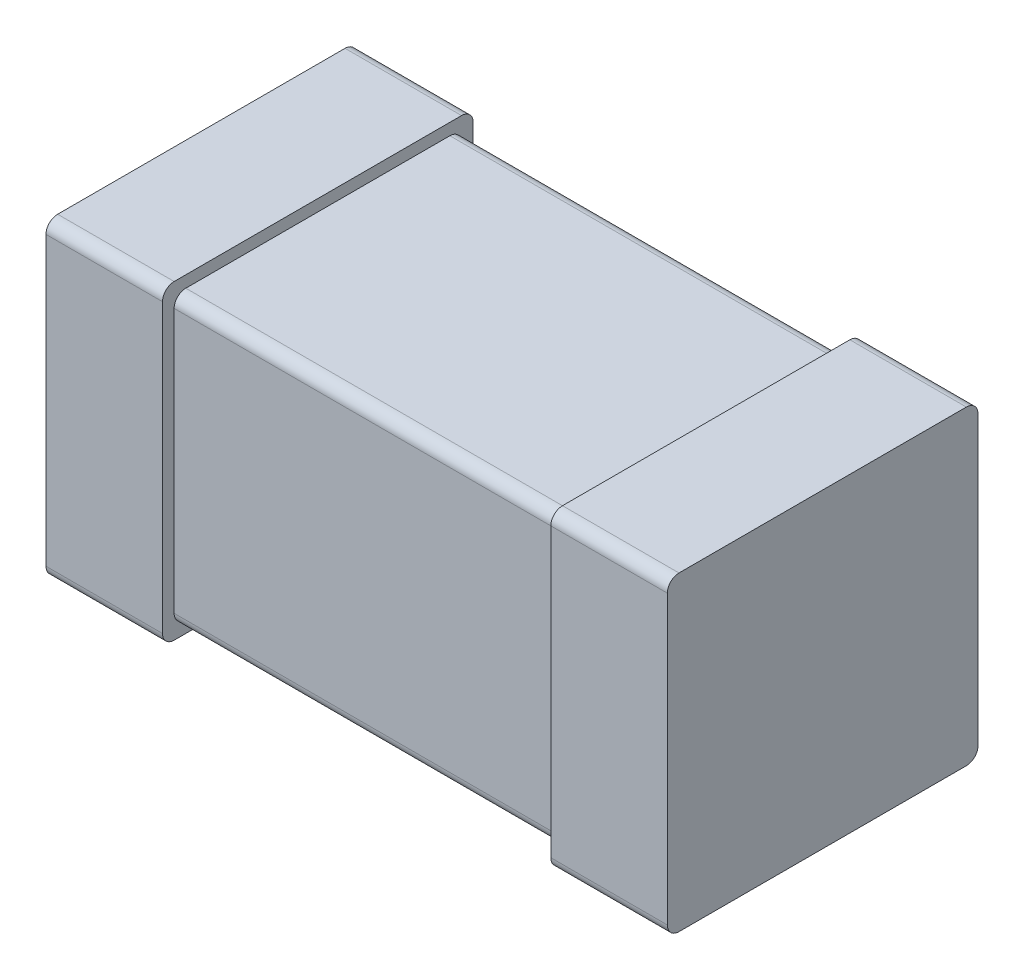
ISO-10303-21;
HEADER;
FILE_DESCRIPTION(('STEP AP214'),'2;1');
FILE_NAME('part.step','',(''),(''),'','','');
FILE_SCHEMA(('AUTOMOTIVE_DESIGN { 1 0 10303 214 1 1 1 1 }'));
ENDSEC;
DATA;
#1=APPLICATION_CONTEXT('core data for automotive mechanical design processes');
#2=APPLICATION_PROTOCOL_DEFINITION('international standard','automotive_design',2000,#1);
#3=PRODUCT_CONTEXT('',#1,'mechanical');
#4=PRODUCT('Part','Part','',(#3));
#5=PRODUCT_RELATED_PRODUCT_CATEGORY('part','',(#4));
#6=PRODUCT_DEFINITION_FORMATION('','',#4);
#7=PRODUCT_DEFINITION_CONTEXT('part definition',#1,'design');
#8=PRODUCT_DEFINITION('design','',#6,#7);
#9=PRODUCT_DEFINITION_SHAPE('','',#8);
#10=(LENGTH_UNIT() NAMED_UNIT(*) SI_UNIT(.MILLI.,.METRE.));
#11=(NAMED_UNIT(*) PLANE_ANGLE_UNIT() SI_UNIT($,.RADIAN.));
#12=(NAMED_UNIT(*) SI_UNIT($,.STERADIAN.) SOLID_ANGLE_UNIT());
#13=UNCERTAINTY_MEASURE_WITH_UNIT(LENGTH_MEASURE(1.E-05),#10,'distance_accuracy_value','');
#14=(GEOMETRIC_REPRESENTATION_CONTEXT(3) GLOBAL_UNCERTAINTY_ASSIGNED_CONTEXT((#13)) GLOBAL_UNIT_ASSIGNED_CONTEXT((#10,
#11,#12)) REPRESENTATION_CONTEXT('',''));
#15=CARTESIAN_POINT('',(0.,0.,0.));
#16=DIRECTION('',(0.,0.,1.));
#17=DIRECTION('',(1.,0.,0.));
#18=AXIS2_PLACEMENT_3D('',#15,#16,#17);
#19=CARTESIAN_POINT('',(118.743244279938,101.39204329235,142.211582908599));
#20=DIRECTION('',(1.,0.,0.));
#21=DIRECTION('',(0.,1.,0.));
#22=AXIS2_PLACEMENT_3D('',#19,#20,#21);
#23=PLANE('',#22);
#24=DIRECTION('',(0.,0.,1.));
#25=VECTOR('',#24,1.);
#26=CARTESIAN_POINT('',(118.743244279938,101.39204329235,142.211582908599));
#27=LINE('',#26,#25);
#28=CARTESIAN_POINT('',(118.743244279938,101.39204329235,142.241582908599));
#29=VERTEX_POINT('',#28);
#30=CARTESIAN_POINT('',(118.743244279938,101.39204329235,142.981582908599));
#31=VERTEX_POINT('',#30);
#32=EDGE_CURVE('E67',#29,#31,#27,.T.);
#33=ORIENTED_EDGE('',*,*,#32,.F.);
#34=CARTESIAN_POINT('',(118.743244279938,101.42204329235,142.241582908599));
#35=DIRECTION('',(1.,0.,0.));
#36=DIRECTION('',(0.,0.,1.));
#37=AXIS2_PLACEMENT_3D('',#34,#35,#36);
#38=CIRCLE('',#37,0.0300000000000023);
#39=CARTESIAN_POINT('',(118.743244279938,101.42204329235,142.211582908599));
#40=VERTEX_POINT('',#39);
#41=EDGE_CURVE('E11',#29,#40,#38,.T.);
#42=ORIENTED_EDGE('',*,*,#41,.T.);
#43=DIRECTION('',(0.,1.,0.));
#44=VECTOR('',#43,1.);
#45=CARTESIAN_POINT('',(118.743244279938,101.39204329235,142.211582908599));
#46=LINE('',#45,#44);
#47=CARTESIAN_POINT('',(118.743244279938,102.16204329235,142.211582908599));
#48=VERTEX_POINT('',#47);
#49=EDGE_CURVE('E55',#40,#48,#46,.T.);
#50=ORIENTED_EDGE('',*,*,#49,.T.);
#51=CARTESIAN_POINT('',(118.743244279938,102.16204329235,142.241582908599));
#52=DIRECTION('',(-1.,0.,0.));
#53=DIRECTION('',(0.,0.,1.));
#54=AXIS2_PLACEMENT_3D('',#51,#52,#53);
#55=CIRCLE('',#54,0.0300000000000023);
#56=CARTESIAN_POINT('',(118.743244279938,102.19204329235,142.241582908599));
#57=VERTEX_POINT('',#56);
#58=EDGE_CURVE('E48',#57,#48,#55,.T.);
#59=ORIENTED_EDGE('',*,*,#58,.F.);
#60=DIRECTION('',(0.,0.,1.));
#61=VECTOR('',#60,1.);
#62=CARTESIAN_POINT('',(118.743244279938,102.19204329235,142.211582908599));
#63=LINE('',#62,#61);
#64=CARTESIAN_POINT('',(118.743244279938,102.19204329235,142.981582908599));
#65=VERTEX_POINT('',#64);
#66=EDGE_CURVE('E367',#57,#65,#63,.T.);
#67=ORIENTED_EDGE('',*,*,#66,.T.);
#68=CARTESIAN_POINT('',(118.743244279938,102.16204329235,142.981582908599));
#69=DIRECTION('',(1.,0.,0.));
#70=DIRECTION('',(0.,0.,1.));
#71=AXIS2_PLACEMENT_3D('',#68,#69,#70);
#72=CIRCLE('',#71,0.0300000000000023);
#73=CARTESIAN_POINT('',(118.743244279938,102.16204329235,143.011582908599));
#74=VERTEX_POINT('',#73);
#75=EDGE_CURVE('E371',#65,#74,#72,.T.);
#76=ORIENTED_EDGE('',*,*,#75,.T.);
#77=DIRECTION('',(0.,1.,0.));
#78=VECTOR('',#77,1.);
#79=CARTESIAN_POINT('',(118.743244279938,101.39204329235,143.011582908599));
#80=LINE('',#79,#78);
#81=CARTESIAN_POINT('',(118.743244279938,101.42204329235,143.011582908599));
#82=VERTEX_POINT('',#81);
#83=EDGE_CURVE('E327',#82,#74,#80,.T.);
#84=ORIENTED_EDGE('',*,*,#83,.F.);
#85=CARTESIAN_POINT('',(118.743244279938,101.42204329235,142.981582908599));
#86=DIRECTION('',(-1.,0.,0.));
#87=DIRECTION('',(0.,0.,1.));
#88=AXIS2_PLACEMENT_3D('',#85,#86,#87);
#89=CIRCLE('',#88,0.0300000000000023);
#90=EDGE_CURVE('E457',#31,#82,#89,.T.);
#91=ORIENTED_EDGE('',*,*,#90,.F.);
#92=EDGE_LOOP('',(#33,#42,#50,#59,#67,#76,#84,#91));
#93=FACE_BOUND('',#92,.T.);
#94=ADVANCED_FACE('F44',(#93),#23,.T.);
#95=CARTESIAN_POINT('',(118.443244279938,102.19204329235,142.211582908599));
#96=DIRECTION('',(0.,1.,0.));
#97=DIRECTION('',(1.,0.,0.));
#98=AXIS2_PLACEMENT_3D('',#95,#96,#97);
#99=PLANE('',#98);
#100=ORIENTED_EDGE('',*,*,#66,.F.);
#101=DIRECTION('',(1.,0.,0.));
#102=VECTOR('',#101,1.);
#103=CARTESIAN_POINT('',(118.443244279938,102.19204329235,142.241582908599));
#104=LINE('',#103,#102);
#105=CARTESIAN_POINT('',(118.443244279938,102.19204329235,142.241582908599));
#106=VERTEX_POINT('',#105);
#107=EDGE_CURVE('E316',#106,#57,#104,.T.);
#108=ORIENTED_EDGE('',*,*,#107,.F.);
#109=DIRECTION('',(0.,0.,1.));
#110=VECTOR('',#109,1.);
#111=CARTESIAN_POINT('',(118.443244279938,102.19204329235,142.211582908599));
#112=LINE('',#111,#110);
#113=CARTESIAN_POINT('',(118.443244279938,102.19204329235,142.981582908599));
#114=VERTEX_POINT('',#113);
#115=EDGE_CURVE('E382',#106,#114,#112,.T.);
#116=ORIENTED_EDGE('',*,*,#115,.T.);
#117=DIRECTION('',(1.,0.,0.));
#118=VECTOR('',#117,1.);
#119=CARTESIAN_POINT('',(118.443244279938,102.19204329235,142.981582908599));
#120=LINE('',#119,#118);
#121=EDGE_CURVE('E403',#114,#65,#120,.T.);
#122=ORIENTED_EDGE('',*,*,#121,.T.);
#123=EDGE_LOOP('',(#100,#108,#116,#122));
#124=FACE_BOUND('',#123,.T.);
#125=ADVANCED_FACE('F580',(#124),#99,.T.);
#126=CARTESIAN_POINT('',(118.443244279938,102.16204329235,142.981582908599));
#127=DIRECTION('',(1.,0.,0.));
#128=DIRECTION('',(0.,1.,0.));
#129=AXIS2_PLACEMENT_3D('',#126,#127,#128);
#130=CYLINDRICAL_SURFACE('',#129,0.0300000000000023);
#131=CARTESIAN_POINT('',(118.443244279938,102.16204329235,142.981582908599));
#132=DIRECTION('',(1.,0.,0.));
#133=DIRECTION('',(0.,0.,1.));
#134=AXIS2_PLACEMENT_3D('',#131,#132,#133);
#135=CIRCLE('',#134,0.0300000000000023);
#136=CARTESIAN_POINT('',(118.443244279938,102.16204329235,143.011582908599));
#137=VERTEX_POINT('',#136);
#138=EDGE_CURVE('E405',#114,#137,#135,.T.);
#139=ORIENTED_EDGE('',*,*,#138,.T.);
#140=DIRECTION('',(1.,0.,0.));
#141=VECTOR('',#140,1.);
#142=CARTESIAN_POINT('',(118.443244279938,102.16204329235,143.011582908599));
#143=LINE('',#142,#141);
#144=EDGE_CURVE('E410',#137,#74,#143,.T.);
#145=ORIENTED_EDGE('',*,*,#144,.T.);
#146=ORIENTED_EDGE('',*,*,#75,.F.);
#147=ORIENTED_EDGE('',*,*,#121,.F.);
#148=EDGE_LOOP('',(#139,#145,#146,#147));
#149=FACE_BOUND('',#148,.T.);
#150=ADVANCED_FACE('F585',(#149),#130,.T.);
#151=CARTESIAN_POINT('',(118.443244279938,102.16204329235,142.241582908599));
#152=DIRECTION('',(1.,0.,0.));
#153=DIRECTION('',(0.,1.,0.));
#154=AXIS2_PLACEMENT_3D('',#151,#152,#153);
#155=CYLINDRICAL_SURFACE('',#154,0.0300000000000023);
#156=ORIENTED_EDGE('',*,*,#107,.T.);
#157=ORIENTED_EDGE('',*,*,#58,.T.);
#158=DIRECTION('',(1.,0.,0.));
#159=VECTOR('',#158,1.);
#160=CARTESIAN_POINT('',(118.443244279938,102.16204329235,142.211582908599));
#161=LINE('',#160,#159);
#162=CARTESIAN_POINT('',(118.443244279938,102.16204329235,142.211582908599));
#163=VERTEX_POINT('',#162);
#164=EDGE_CURVE('E442',#163,#48,#161,.T.);
#165=ORIENTED_EDGE('',*,*,#164,.F.);
#166=CARTESIAN_POINT('',(118.443244279938,102.16204329235,142.241582908599));
#167=DIRECTION('',(-1.,0.,0.));
#168=DIRECTION('',(0.,0.,1.));
#169=AXIS2_PLACEMENT_3D('',#166,#167,#168);
#170=CIRCLE('',#169,0.0300000000000023);
#171=EDGE_CURVE('E321',#106,#163,#170,.T.);
#172=ORIENTED_EDGE('',*,*,#171,.F.);
#173=EDGE_LOOP('',(#156,#157,#165,#172));
#174=FACE_BOUND('',#173,.T.);
#175=ADVANCED_FACE('F746',(#174),#155,.T.);
#176=CARTESIAN_POINT('',(118.443244279938,101.39204329235,143.011582908599));
#177=DIRECTION('',(0.,0.,1.));
#178=DIRECTION('',(1.,0.,0.));
#179=AXIS2_PLACEMENT_3D('',#176,#177,#178);
#180=PLANE('',#179);
#181=DIRECTION('',(0.,1.,0.));
#182=VECTOR('',#181,1.);
#183=CARTESIAN_POINT('',(118.443244279938,101.39204329235,143.011582908599));
#184=LINE('',#183,#182);
#185=CARTESIAN_POINT('',(118.443244279938,101.42204329235,143.011582908599));
#186=VERTEX_POINT('',#185);
#187=EDGE_CURVE('E411',#186,#137,#184,.T.);
#188=ORIENTED_EDGE('',*,*,#187,.F.);
#189=DIRECTION('',(1.,0.,0.));
#190=VECTOR('',#189,1.);
#191=CARTESIAN_POINT('',(118.443244279938,101.42204329235,143.011582908599));
#192=LINE('',#191,#190);
#193=EDGE_CURVE('E323',#186,#82,#192,.T.);
#194=ORIENTED_EDGE('',*,*,#193,.T.);
#195=ORIENTED_EDGE('',*,*,#83,.T.);
#196=ORIENTED_EDGE('',*,*,#144,.F.);
#197=EDGE_LOOP('',(#188,#194,#195,#196));
#198=FACE_BOUND('',#197,.T.);
#199=ADVANCED_FACE('F750',(#198),#180,.T.);
#200=CARTESIAN_POINT('',(118.443244279938,101.39204329235,142.211582908599));
#201=DIRECTION('',(0.,0.,1.));
#202=DIRECTION('',(1.,0.,0.));
#203=AXIS2_PLACEMENT_3D('',#200,#201,#202);
#204=PLANE('',#203);
#205=ORIENTED_EDGE('',*,*,#164,.T.);
#206=ORIENTED_EDGE('',*,*,#49,.F.);
#207=DIRECTION('',(1.,0.,0.));
#208=VECTOR('',#207,1.);
#209=CARTESIAN_POINT('',(118.443244279938,101.42204329235,142.211582908599));
#210=LINE('',#209,#208);
#211=CARTESIAN_POINT('',(118.443244279938,101.42204329235,142.211582908599));
#212=VERTEX_POINT('',#211);
#213=EDGE_CURVE('E484',#212,#40,#210,.T.);
#214=ORIENTED_EDGE('',*,*,#213,.F.);
#215=DIRECTION('',(0.,1.,0.));
#216=VECTOR('',#215,1.);
#217=CARTESIAN_POINT('',(118.443244279938,101.39204329235,142.211582908599));
#218=LINE('',#217,#216);
#219=EDGE_CURVE('E438',#212,#163,#218,.T.);
#220=ORIENTED_EDGE('',*,*,#219,.T.);
#221=EDGE_LOOP('',(#205,#206,#214,#220));
#222=FACE_BOUND('',#221,.T.);
#223=ADVANCED_FACE('F702',(#222),#204,.F.);
#224=CARTESIAN_POINT('',(118.443244279938,101.42204329235,142.981582908599));
#225=DIRECTION('',(1.,0.,0.));
#226=DIRECTION('',(0.,-1.,0.));
#227=AXIS2_PLACEMENT_3D('',#224,#225,#226);
#228=CYLINDRICAL_SURFACE('',#227,0.0300000000000023);
#229=DIRECTION('',(1.,0.,0.));
#230=VECTOR('',#229,1.);
#231=CARTESIAN_POINT('',(118.443244279938,101.39204329235,142.981582908599));
#232=LINE('',#231,#230);
#233=CARTESIAN_POINT('',(118.443244279938,101.39204329235,142.981582908599));
#234=VERTEX_POINT('',#233);
#235=EDGE_CURVE('E443',#234,#31,#232,.T.);
#236=ORIENTED_EDGE('',*,*,#235,.T.);
#237=ORIENTED_EDGE('',*,*,#90,.T.);
#238=ORIENTED_EDGE('',*,*,#193,.F.);
#239=CARTESIAN_POINT('',(118.443244279938,101.42204329235,142.981582908599));
#240=DIRECTION('',(-1.,0.,0.));
#241=DIRECTION('',(0.,0.,1.));
#242=AXIS2_PLACEMENT_3D('',#239,#240,#241);
#243=CIRCLE('',#242,0.0300000000000023);
#244=EDGE_CURVE('E356',#234,#186,#243,.T.);
#245=ORIENTED_EDGE('',*,*,#244,.F.);
#246=EDGE_LOOP('',(#236,#237,#238,#245));
#247=FACE_BOUND('',#246,.T.);
#248=ADVANCED_FACE('F698',(#247),#228,.T.);
#249=CARTESIAN_POINT('',(118.443244279938,101.42204329235,142.241582908599));
#250=DIRECTION('',(1.,0.,0.));
#251=DIRECTION('',(0.,-1.,0.));
#252=AXIS2_PLACEMENT_3D('',#249,#250,#251);
#253=CYLINDRICAL_SURFACE('',#252,0.0300000000000023);
#254=CARTESIAN_POINT('',(118.443244279938,101.42204329235,142.241582908599));
#255=DIRECTION('',(1.,0.,0.));
#256=DIRECTION('',(0.,0.,1.));
#257=AXIS2_PLACEMENT_3D('',#254,#255,#256);
#258=CIRCLE('',#257,0.0300000000000023);
#259=CARTESIAN_POINT('',(118.443244279938,101.39204329235,142.241582908599));
#260=VERTEX_POINT('',#259);
#261=EDGE_CURVE('E463',#260,#212,#258,.T.);
#262=ORIENTED_EDGE('',*,*,#261,.T.);
#263=ORIENTED_EDGE('',*,*,#213,.T.);
#264=ORIENTED_EDGE('',*,*,#41,.F.);
#265=DIRECTION('',(1.,0.,0.));
#266=VECTOR('',#265,1.);
#267=CARTESIAN_POINT('',(118.443244279938,101.39204329235,142.241582908599));
#268=LINE('',#267,#266);
#269=EDGE_CURVE('E355',#260,#29,#268,.T.);
#270=ORIENTED_EDGE('',*,*,#269,.F.);
#271=EDGE_LOOP('',(#262,#263,#264,#270));
#272=FACE_BOUND('',#271,.T.);
#273=ADVANCED_FACE('F634',(#272),#253,.T.);
#274=CARTESIAN_POINT('',(118.443244279938,101.39204329235,142.211582908599));
#275=DIRECTION('',(0.,1.,0.));
#276=DIRECTION('',(1.,0.,0.));
#277=AXIS2_PLACEMENT_3D('',#274,#275,#276);
#278=PLANE('',#277);
#279=ORIENTED_EDGE('',*,*,#235,.F.);
#280=DIRECTION('',(0.,0.,1.));
#281=VECTOR('',#280,1.);
#282=CARTESIAN_POINT('',(118.443244279938,101.39204329235,142.211582908599));
#283=LINE('',#282,#281);
#284=EDGE_CURVE('E318',#260,#234,#283,.T.);
#285=ORIENTED_EDGE('',*,*,#284,.F.);
#286=ORIENTED_EDGE('',*,*,#269,.T.);
#287=ORIENTED_EDGE('',*,*,#32,.T.);
#288=EDGE_LOOP('',(#279,#285,#286,#287));
#289=FACE_BOUND('',#288,.T.);
#290=ADVANCED_FACE('F630',(#289),#278,.F.);
#291=CARTESIAN_POINT('',(118.443244279938,101.39204329235,142.211582908599));
#292=DIRECTION('',(1.,0.,0.));
#293=DIRECTION('',(0.,1.,0.));
#294=AXIS2_PLACEMENT_3D('',#291,#292,#293);
#295=PLANE('',#294);
#296=ORIENTED_EDGE('',*,*,#244,.T.);
#297=ORIENTED_EDGE('',*,*,#187,.T.);
#298=ORIENTED_EDGE('',*,*,#138,.F.);
#299=ORIENTED_EDGE('',*,*,#115,.F.);
#300=ORIENTED_EDGE('',*,*,#171,.T.);
#301=ORIENTED_EDGE('',*,*,#219,.F.);
#302=ORIENTED_EDGE('',*,*,#261,.F.);
#303=ORIENTED_EDGE('',*,*,#284,.T.);
#304=EDGE_LOOP('',(#296,#297,#298,#299,#300,#301,#302,#303));
#305=FACE_BOUND('',#304,.T.);
#306=DIRECTION('',(0.,1.,0.));
#307=VECTOR('',#306,1.);
#308=CARTESIAN_POINT('',(118.443244279938,101.42204329235,142.241582908599));
#309=LINE('',#308,#307);
#310=CARTESIAN_POINT('',(118.443244279938,101.45204329235,142.241582908599));
#311=VERTEX_POINT('',#310);
#312=CARTESIAN_POINT('',(118.443244279938,102.13204329235,142.241582908599));
#313=VERTEX_POINT('',#312);
#314=EDGE_CURVE('E322',#311,#313,#309,.T.);
#315=ORIENTED_EDGE('',*,*,#314,.T.);
#316=CARTESIAN_POINT('',(118.443244279938,102.13204329235,142.271582908599));
#317=DIRECTION('',(-1.,0.,0.));
#318=DIRECTION('',(0.,0.,1.));
#319=AXIS2_PLACEMENT_3D('',#316,#317,#318);
#320=CIRCLE('',#319,0.0300000000000023);
#321=CARTESIAN_POINT('',(118.443244279938,102.16204329235,142.271582908599));
#322=VERTEX_POINT('',#321);
#323=EDGE_CURVE('E433',#322,#313,#320,.T.);
#324=ORIENTED_EDGE('',*,*,#323,.F.);
#325=DIRECTION('',(0.,0.,1.));
#326=VECTOR('',#325,1.);
#327=CARTESIAN_POINT('',(118.443244279938,102.16204329235,142.241582908599));
#328=LINE('',#327,#326);
#329=CARTESIAN_POINT('',(118.443244279938,102.16204329235,142.951582908599));
#330=VERTEX_POINT('',#329);
#331=EDGE_CURVE('E385',#322,#330,#328,.T.);
#332=ORIENTED_EDGE('',*,*,#331,.T.);
#333=CARTESIAN_POINT('',(118.443244279938,102.13204329235,142.951582908599));
#334=DIRECTION('',(1.,0.,0.));
#335=DIRECTION('',(0.,0.,1.));
#336=AXIS2_PLACEMENT_3D('',#333,#334,#335);
#337=CIRCLE('',#336,0.0300000000000023);
#338=CARTESIAN_POINT('',(118.443244279938,102.13204329235,142.981582908599));
#339=VERTEX_POINT('',#338);
#340=EDGE_CURVE('E330',#330,#339,#337,.T.);
#341=ORIENTED_EDGE('',*,*,#340,.T.);
#342=DIRECTION('',(0.,1.,0.));
#343=VECTOR('',#342,1.);
#344=CARTESIAN_POINT('',(118.443244279938,101.42204329235,142.981582908599));
#345=LINE('',#344,#343);
#346=CARTESIAN_POINT('',(118.443244279938,101.45204329235,142.981582908599));
#347=VERTEX_POINT('',#346);
#348=EDGE_CURVE('E336',#347,#339,#345,.T.);
#349=ORIENTED_EDGE('',*,*,#348,.F.);
#350=CARTESIAN_POINT('',(118.443244279938,101.45204329235,142.951582908599));
#351=DIRECTION('',(-1.,0.,0.));
#352=DIRECTION('',(0.,0.,1.));
#353=AXIS2_PLACEMENT_3D('',#350,#351,#352);
#354=CIRCLE('',#353,0.0300000000000023);
#355=CARTESIAN_POINT('',(118.443244279938,101.42204329235,142.951582908599));
#356=VERTEX_POINT('',#355);
#357=EDGE_CURVE('E415',#356,#347,#354,.T.);
#358=ORIENTED_EDGE('',*,*,#357,.F.);
#359=DIRECTION('',(0.,0.,1.));
#360=VECTOR('',#359,1.);
#361=CARTESIAN_POINT('',(118.443244279938,101.42204329235,142.241582908599));
#362=LINE('',#361,#360);
#363=CARTESIAN_POINT('',(118.443244279938,101.42204329235,142.271582908599));
#364=VERTEX_POINT('',#363);
#365=EDGE_CURVE('E215',#364,#356,#362,.T.);
#366=ORIENTED_EDGE('',*,*,#365,.F.);
#367=CARTESIAN_POINT('',(118.443244279938,101.45204329235,142.271582908599));
#368=DIRECTION('',(1.,0.,0.));
#369=DIRECTION('',(0.,0.,1.));
#370=AXIS2_PLACEMENT_3D('',#367,#368,#369);
#371=CIRCLE('',#370,0.0300000000000023);
#372=EDGE_CURVE('E223',#364,#311,#371,.T.);
#373=ORIENTED_EDGE('',*,*,#372,.T.);
#374=EDGE_LOOP('',(#315,#324,#332,#341,#349,#358,#366,#373));
#375=FACE_BOUND('',#374,.T.);
#376=ADVANCED_FACE('F518',(#305,#375),#295,.F.);
#377=CARTESIAN_POINT('',(117.443244279938,101.42204329235,142.241582908599));
#378=DIRECTION('',(0.,1.,0.));
#379=DIRECTION('',(1.,0.,0.));
#380=AXIS2_PLACEMENT_3D('',#377,#378,#379);
#381=PLANE('',#380);
#382=DIRECTION('',(1.,0.,0.));
#383=VECTOR('',#382,1.);
#384=CARTESIAN_POINT('',(117.443244279938,101.42204329235,142.951582908599));
#385=LINE('',#384,#383);
#386=CARTESIAN_POINT('',(117.443244279938,101.42204329235,142.951582908599));
#387=VERTEX_POINT('',#386);
#388=EDGE_CURVE('E419',#387,#356,#385,.T.);
#389=ORIENTED_EDGE('',*,*,#388,.F.);
#390=DIRECTION('',(0.,0.,1.));
#391=VECTOR('',#390,1.);
#392=CARTESIAN_POINT('',(117.443244279938,101.42204329235,142.241582908599));
#393=LINE('',#392,#391);
#394=CARTESIAN_POINT('',(117.443244279938,101.42204329235,142.271582908599));
#395=VERTEX_POINT('',#394);
#396=EDGE_CURVE('E263',#395,#387,#393,.T.);
#397=ORIENTED_EDGE('',*,*,#396,.F.);
#398=DIRECTION('',(1.,0.,0.));
#399=VECTOR('',#398,1.);
#400=CARTESIAN_POINT('',(117.443244279938,101.42204329235,142.271582908599));
#401=LINE('',#400,#399);
#402=EDGE_CURVE('E331',#395,#364,#401,.T.);
#403=ORIENTED_EDGE('',*,*,#402,.T.);
#404=ORIENTED_EDGE('',*,*,#365,.T.);
#405=EDGE_LOOP('',(#389,#397,#403,#404));
#406=FACE_BOUND('',#405,.T.);
#407=ADVANCED_FACE('F519',(#406),#381,.F.);
#408=CARTESIAN_POINT('',(117.443244279938,101.45204329235,142.951582908599));
#409=DIRECTION('',(1.,0.,0.));
#410=DIRECTION('',(0.,-1.,0.));
#411=AXIS2_PLACEMENT_3D('',#408,#409,#410);
#412=CYLINDRICAL_SURFACE('',#411,0.0300000000000023);
#413=ORIENTED_EDGE('',*,*,#388,.T.);
#414=ORIENTED_EDGE('',*,*,#357,.T.);
#415=DIRECTION('',(1.,0.,0.));
#416=VECTOR('',#415,1.);
#417=CARTESIAN_POINT('',(117.443244279938,101.45204329235,142.981582908599));
#418=LINE('',#417,#416);
#419=CARTESIAN_POINT('',(117.443244279938,101.45204329235,142.981582908599));
#420=VERTEX_POINT('',#419);
#421=EDGE_CURVE('E344',#420,#347,#418,.T.);
#422=ORIENTED_EDGE('',*,*,#421,.F.);
#423=CARTESIAN_POINT('',(117.443244279938,101.45204329235,142.951582908599));
#424=DIRECTION('',(-1.,0.,0.));
#425=DIRECTION('',(0.,0.,1.));
#426=AXIS2_PLACEMENT_3D('',#423,#424,#425);
#427=CIRCLE('',#426,0.0300000000000023);
#428=EDGE_CURVE('E252',#387,#420,#427,.T.);
#429=ORIENTED_EDGE('',*,*,#428,.F.);
#430=EDGE_LOOP('',(#413,#414,#422,#429));
#431=FACE_BOUND('',#430,.T.);
#432=ADVANCED_FACE('F517',(#431),#412,.T.);
#433=CARTESIAN_POINT('',(117.443244279938,101.42204329235,142.981582908599));
#434=DIRECTION('',(0.,0.,1.));
#435=DIRECTION('',(1.,0.,0.));
#436=AXIS2_PLACEMENT_3D('',#433,#434,#435);
#437=PLANE('',#436);
#438=DIRECTION('',(0.,1.,0.));
#439=VECTOR('',#438,1.);
#440=CARTESIAN_POINT('',(117.443244279938,101.42204329235,142.981582908599));
#441=LINE('',#440,#439);
#442=CARTESIAN_POINT('',(117.443244279938,102.13204329235,142.981582908599));
#443=VERTEX_POINT('',#442);
#444=EDGE_CURVE('E347',#420,#443,#441,.T.);
#445=ORIENTED_EDGE('',*,*,#444,.F.);
#446=ORIENTED_EDGE('',*,*,#421,.T.);
#447=ORIENTED_EDGE('',*,*,#348,.T.);
#448=DIRECTION('',(1.,0.,0.));
#449=VECTOR('',#448,1.);
#450=CARTESIAN_POINT('',(117.443244279938,102.13204329235,142.981582908599));
#451=LINE('',#450,#449);
#452=EDGE_CURVE('E337',#443,#339,#451,.T.);
#453=ORIENTED_EDGE('',*,*,#452,.F.);
#454=EDGE_LOOP('',(#445,#446,#447,#453));
#455=FACE_BOUND('',#454,.T.);
#456=ADVANCED_FACE('F513',(#455),#437,.T.);
#457=CARTESIAN_POINT('',(117.443244279938,102.13204329235,142.951582908599));
#458=DIRECTION('',(1.,0.,0.));
#459=DIRECTION('',(0.,1.,0.));
#460=AXIS2_PLACEMENT_3D('',#457,#458,#459);
#461=CYLINDRICAL_SURFACE('',#460,0.0300000000000023);
#462=CARTESIAN_POINT('',(117.443244279938,102.13204329235,142.951582908599));
#463=DIRECTION('',(1.,0.,0.));
#464=DIRECTION('',(0.,0.,1.));
#465=AXIS2_PLACEMENT_3D('',#462,#463,#464);
#466=CIRCLE('',#465,0.0300000000000023);
#467=CARTESIAN_POINT('',(117.443244279938,102.16204329235,142.951582908599));
#468=VERTEX_POINT('',#467);
#469=EDGE_CURVE('E332',#468,#443,#466,.T.);
#470=ORIENTED_EDGE('',*,*,#469,.T.);
#471=ORIENTED_EDGE('',*,*,#452,.T.);
#472=ORIENTED_EDGE('',*,*,#340,.F.);
#473=DIRECTION('',(1.,0.,0.));
#474=VECTOR('',#473,1.);
#475=CARTESIAN_POINT('',(117.443244279938,102.16204329235,142.951582908599));
#476=LINE('',#475,#474);
#477=EDGE_CURVE('E424',#468,#330,#476,.T.);
#478=ORIENTED_EDGE('',*,*,#477,.F.);
#479=EDGE_LOOP('',(#470,#471,#472,#478));
#480=FACE_BOUND('',#479,.T.);
#481=ADVANCED_FACE('F594',(#480),#461,.T.);
#482=CARTESIAN_POINT('',(117.443244279938,102.16204329235,142.241582908599));
#483=DIRECTION('',(0.,1.,0.));
#484=DIRECTION('',(1.,0.,0.));
#485=AXIS2_PLACEMENT_3D('',#482,#483,#484);
#486=PLANE('',#485);
#487=ORIENTED_EDGE('',*,*,#331,.F.);
#488=DIRECTION('',(1.,0.,0.));
#489=VECTOR('',#488,1.);
#490=CARTESIAN_POINT('',(117.443244279938,102.16204329235,142.271582908599));
#491=LINE('',#490,#489);
#492=CARTESIAN_POINT('',(117.443244279938,102.16204329235,142.271582908599));
#493=VERTEX_POINT('',#492);
#494=EDGE_CURVE('E487',#493,#322,#491,.T.);
#495=ORIENTED_EDGE('',*,*,#494,.F.);
#496=DIRECTION('',(0.,0.,1.));
#497=VECTOR('',#496,1.);
#498=CARTESIAN_POINT('',(117.443244279938,102.16204329235,142.241582908599));
#499=LINE('',#498,#497);
#500=EDGE_CURVE('E420',#493,#468,#499,.T.);
#501=ORIENTED_EDGE('',*,*,#500,.T.);
#502=ORIENTED_EDGE('',*,*,#477,.T.);
#503=EDGE_LOOP('',(#487,#495,#501,#502));
#504=FACE_BOUND('',#503,.T.);
#505=ADVANCED_FACE('F590',(#504),#486,.T.);
#506=CARTESIAN_POINT('',(117.443244279938,102.13204329235,142.271582908599));
#507=DIRECTION('',(1.,0.,0.));
#508=DIRECTION('',(0.,1.,0.));
#509=AXIS2_PLACEMENT_3D('',#506,#507,#508);
#510=CYLINDRICAL_SURFACE('',#509,0.0300000000000023);
#511=ORIENTED_EDGE('',*,*,#494,.T.);
#512=ORIENTED_EDGE('',*,*,#323,.T.);
#513=DIRECTION('',(1.,0.,0.));
#514=VECTOR('',#513,1.);
#515=CARTESIAN_POINT('',(117.443244279938,102.13204329235,142.241582908599));
#516=LINE('',#515,#514);
#517=CARTESIAN_POINT('',(117.443244279938,102.13204329235,142.241582908599));
#518=VERTEX_POINT('',#517);
#519=EDGE_CURVE('E430',#518,#313,#516,.T.);
#520=ORIENTED_EDGE('',*,*,#519,.F.);
#521=CARTESIAN_POINT('',(117.443244279938,102.13204329235,142.271582908599));
#522=DIRECTION('',(-1.,0.,0.));
#523=DIRECTION('',(0.,0.,1.));
#524=AXIS2_PLACEMENT_3D('',#521,#522,#523);
#525=CIRCLE('',#524,0.0300000000000023);
#526=EDGE_CURVE('E340',#493,#518,#525,.T.);
#527=ORIENTED_EDGE('',*,*,#526,.F.);
#528=EDGE_LOOP('',(#511,#512,#520,#527));
#529=FACE_BOUND('',#528,.T.);
#530=ADVANCED_FACE('F593',(#529),#510,.T.);
#531=CARTESIAN_POINT('',(117.443244279938,101.42204329235,142.241582908599));
#532=DIRECTION('',(0.,0.,1.));
#533=DIRECTION('',(1.,0.,0.));
#534=AXIS2_PLACEMENT_3D('',#531,#532,#533);
#535=PLANE('',#534);
#536=ORIENTED_EDGE('',*,*,#519,.T.);
#537=ORIENTED_EDGE('',*,*,#314,.F.);
#538=DIRECTION('',(1.,0.,0.));
#539=VECTOR('',#538,1.);
#540=CARTESIAN_POINT('',(117.443244279938,101.45204329235,142.241582908599));
#541=LINE('',#540,#539);
#542=CARTESIAN_POINT('',(117.443244279938,101.45204329235,142.241582908599));
#543=VERTEX_POINT('',#542);
#544=EDGE_CURVE('E425',#543,#311,#541,.T.);
#545=ORIENTED_EDGE('',*,*,#544,.F.);
#546=DIRECTION('',(0.,1.,0.));
#547=VECTOR('',#546,1.);
#548=CARTESIAN_POINT('',(117.443244279938,101.42204329235,142.241582908599));
#549=LINE('',#548,#547);
#550=EDGE_CURVE('E434',#543,#518,#549,.T.);
#551=ORIENTED_EDGE('',*,*,#550,.T.);
#552=EDGE_LOOP('',(#536,#537,#545,#551));
#553=FACE_BOUND('',#552,.T.);
#554=ADVANCED_FACE('F599',(#553),#535,.F.);
#555=CARTESIAN_POINT('',(117.443244279938,101.45204329235,142.271582908599));
#556=DIRECTION('',(1.,0.,0.));
#557=DIRECTION('',(0.,-1.,0.));
#558=AXIS2_PLACEMENT_3D('',#555,#556,#557);
#559=CYLINDRICAL_SURFACE('',#558,0.0300000000000023);
#560=CARTESIAN_POINT('',(117.443244279938,101.45204329235,142.271582908599));
#561=DIRECTION('',(1.,0.,0.));
#562=DIRECTION('',(0.,0.,1.));
#563=AXIS2_PLACEMENT_3D('',#560,#561,#562);
#564=CIRCLE('',#563,0.0300000000000023);
#565=EDGE_CURVE('E429',#395,#543,#564,.T.);
#566=ORIENTED_EDGE('',*,*,#565,.T.);
#567=ORIENTED_EDGE('',*,*,#544,.T.);
#568=ORIENTED_EDGE('',*,*,#372,.F.);
#569=ORIENTED_EDGE('',*,*,#402,.F.);
#570=EDGE_LOOP('',(#566,#567,#568,#569));
#571=FACE_BOUND('',#570,.T.);
#572=ADVANCED_FACE('F596',(#571),#559,.T.);
#573=CARTESIAN_POINT('',(117.443244279938,101.39204329235,142.211582908599));
#574=DIRECTION('',(1.,0.,0.));
#575=DIRECTION('',(0.,1.,0.));
#576=AXIS2_PLACEMENT_3D('',#573,#574,#575);
#577=PLANE('',#576);
#578=DIRECTION('',(0.,0.,1.));
#579=VECTOR('',#578,1.);
#580=CARTESIAN_POINT('',(117.443244279938,101.39204329235,142.211582908599));
#581=LINE('',#580,#579);
#582=CARTESIAN_POINT('',(117.443244279938,101.39204329235,142.241582908599));
#583=VERTEX_POINT('',#582);
#584=CARTESIAN_POINT('',(117.443244279938,101.39204329235,142.981582908599));
#585=VERTEX_POINT('',#584);
#586=EDGE_CURVE('E206',#583,#585,#581,.T.);
#587=ORIENTED_EDGE('',*,*,#586,.F.);
#588=CARTESIAN_POINT('',(117.443244279938,101.42204329235,142.241582908599));
#589=DIRECTION('',(1.,0.,0.));
#590=DIRECTION('',(0.,0.,1.));
#591=AXIS2_PLACEMENT_3D('',#588,#589,#590);
#592=CIRCLE('',#591,0.0300000000000023);
#593=CARTESIAN_POINT('',(117.443244279938,101.42204329235,142.211582908599));
#594=VERTEX_POINT('',#593);
#595=EDGE_CURVE('E378',#583,#594,#592,.T.);
#596=ORIENTED_EDGE('',*,*,#595,.T.);
#597=DIRECTION('',(0.,1.,0.));
#598=VECTOR('',#597,1.);
#599=CARTESIAN_POINT('',(117.443244279938,101.39204329235,142.211582908599));
#600=LINE('',#599,#598);
#601=CARTESIAN_POINT('',(117.443244279938,102.16204329235,142.211582908599));
#602=VERTEX_POINT('',#601);
#603=EDGE_CURVE('E289',#594,#602,#600,.T.);
#604=ORIENTED_EDGE('',*,*,#603,.T.);
#605=CARTESIAN_POINT('',(117.443244279938,102.16204329235,142.241582908599));
#606=DIRECTION('',(-1.,0.,0.));
#607=DIRECTION('',(0.,0.,1.));
#608=AXIS2_PLACEMENT_3D('',#605,#606,#607);
#609=CIRCLE('',#608,0.0300000000000023);
#610=CARTESIAN_POINT('',(117.443244279938,102.19204329235,142.241582908599));
#611=VERTEX_POINT('',#610);
#612=EDGE_CURVE('E283',#611,#602,#609,.T.);
#613=ORIENTED_EDGE('',*,*,#612,.F.);
#614=DIRECTION('',(0.,0.,1.));
#615=VECTOR('',#614,1.);
#616=CARTESIAN_POINT('',(117.443244279938,102.19204329235,142.211582908599));
#617=LINE('',#616,#615);
#618=CARTESIAN_POINT('',(117.443244279938,102.19204329235,142.981582908599));
#619=VERTEX_POINT('',#618);
#620=EDGE_CURVE('E286',#611,#619,#617,.T.);
#621=ORIENTED_EDGE('',*,*,#620,.T.);
#622=CARTESIAN_POINT('',(117.443244279938,102.16204329235,142.981582908599));
#623=DIRECTION('',(1.,0.,0.));
#624=DIRECTION('',(0.,0.,1.));
#625=AXIS2_PLACEMENT_3D('',#622,#623,#624);
#626=CIRCLE('',#625,0.0300000000000023);
#627=CARTESIAN_POINT('',(117.443244279938,102.16204329235,143.011582908599));
#628=VERTEX_POINT('',#627);
#629=EDGE_CURVE('E299',#619,#628,#626,.T.);
#630=ORIENTED_EDGE('',*,*,#629,.T.);
#631=DIRECTION('',(0.,1.,0.));
#632=VECTOR('',#631,1.);
#633=CARTESIAN_POINT('',(117.443244279938,101.39204329235,143.011582908599));
#634=LINE('',#633,#632);
#635=CARTESIAN_POINT('',(117.443244279938,101.42204329235,143.011582908599));
#636=VERTEX_POINT('',#635);
#637=EDGE_CURVE('E469',#636,#628,#634,.T.);
#638=ORIENTED_EDGE('',*,*,#637,.F.);
#639=CARTESIAN_POINT('',(117.443244279938,101.42204329235,142.981582908599));
#640=DIRECTION('',(-1.,0.,0.));
#641=DIRECTION('',(0.,0.,1.));
#642=AXIS2_PLACEMENT_3D('',#639,#640,#641);
#643=CIRCLE('',#642,0.0300000000000023);
#644=EDGE_CURVE('E447',#585,#636,#643,.T.);
#645=ORIENTED_EDGE('',*,*,#644,.F.);
#646=EDGE_LOOP('',(#587,#596,#604,#613,#621,#630,#638,#645));
#647=FACE_BOUND('',#646,.T.);
#648=ORIENTED_EDGE('',*,*,#565,.F.);
#649=ORIENTED_EDGE('',*,*,#396,.T.);
#650=ORIENTED_EDGE('',*,*,#428,.T.);
#651=ORIENTED_EDGE('',*,*,#444,.T.);
#652=ORIENTED_EDGE('',*,*,#469,.F.);
#653=ORIENTED_EDGE('',*,*,#500,.F.);
#654=ORIENTED_EDGE('',*,*,#526,.T.);
#655=ORIENTED_EDGE('',*,*,#550,.F.);
#656=EDGE_LOOP('',(#648,#649,#650,#651,#652,#653,#654,#655));
#657=FACE_BOUND('',#656,.T.);
#658=ADVANCED_FACE('F284',(#647,#657),#577,.T.);
#659=CARTESIAN_POINT('',(117.143244279938,102.19204329235,142.211582908599));
#660=DIRECTION('',(0.,1.,0.));
#661=DIRECTION('',(1.,0.,0.));
#662=AXIS2_PLACEMENT_3D('',#659,#660,#661);
#663=PLANE('',#662);
#664=ORIENTED_EDGE('',*,*,#620,.F.);
#665=DIRECTION('',(1.,0.,0.));
#666=VECTOR('',#665,1.);
#667=CARTESIAN_POINT('',(117.143244279938,102.19204329235,142.241582908599));
#668=LINE('',#667,#666);
#669=CARTESIAN_POINT('',(117.143244279938,102.19204329235,142.241582908599));
#670=VERTEX_POINT('',#669);
#671=EDGE_CURVE('E195',#670,#611,#668,.T.);
#672=ORIENTED_EDGE('',*,*,#671,.F.);
#673=DIRECTION('',(0.,0.,1.));
#674=VECTOR('',#673,1.);
#675=CARTESIAN_POINT('',(117.143244279938,102.19204329235,142.211582908599));
#676=LINE('',#675,#674);
#677=CARTESIAN_POINT('',(117.143244279938,102.19204329235,142.981582908599));
#678=VERTEX_POINT('',#677);
#679=EDGE_CURVE('E338',#670,#678,#676,.T.);
#680=ORIENTED_EDGE('',*,*,#679,.T.);
#681=DIRECTION('',(1.,0.,0.));
#682=VECTOR('',#681,1.);
#683=CARTESIAN_POINT('',(117.143244279938,102.19204329235,142.981582908599));
#684=LINE('',#683,#682);
#685=EDGE_CURVE('E297',#678,#619,#684,.T.);
#686=ORIENTED_EDGE('',*,*,#685,.T.);
#687=EDGE_LOOP('',(#664,#672,#680,#686));
#688=FACE_BOUND('',#687,.T.);
#689=ADVANCED_FACE('F296',(#688),#663,.T.);
#690=CARTESIAN_POINT('',(117.143244279938,102.16204329235,142.981582908599));
#691=DIRECTION('',(1.,0.,0.));
#692=DIRECTION('',(0.,1.,0.));
#693=AXIS2_PLACEMENT_3D('',#690,#691,#692);
#694=CYLINDRICAL_SURFACE('',#693,0.0300000000000023);
#695=CARTESIAN_POINT('',(117.143244279938,102.16204329235,142.981582908599));
#696=DIRECTION('',(1.,0.,0.));
#697=DIRECTION('',(0.,0.,1.));
#698=AXIS2_PLACEMENT_3D('',#695,#696,#697);
#699=CIRCLE('',#698,0.0300000000000023);
#700=CARTESIAN_POINT('',(117.143244279938,102.16204329235,143.011582908599));
#701=VERTEX_POINT('',#700);
#702=EDGE_CURVE('E312',#678,#701,#699,.T.);
#703=ORIENTED_EDGE('',*,*,#702,.T.);
#704=DIRECTION('',(1.,0.,0.));
#705=VECTOR('',#704,1.);
#706=CARTESIAN_POINT('',(117.143244279938,102.16204329235,143.011582908599));
#707=LINE('',#706,#705);
#708=EDGE_CURVE('E305',#701,#628,#707,.T.);
#709=ORIENTED_EDGE('',*,*,#708,.T.);
#710=ORIENTED_EDGE('',*,*,#629,.F.);
#711=ORIENTED_EDGE('',*,*,#685,.F.);
#712=EDGE_LOOP('',(#703,#709,#710,#711));
#713=FACE_BOUND('',#712,.T.);
#714=ADVANCED_FACE('F834',(#713),#694,.T.);
#715=CARTESIAN_POINT('',(117.143244279938,102.16204329235,142.241582908599));
#716=DIRECTION('',(1.,0.,0.));
#717=DIRECTION('',(0.,1.,0.));
#718=AXIS2_PLACEMENT_3D('',#715,#716,#717);
#719=CYLINDRICAL_SURFACE('',#718,0.0300000000000023);
#720=ORIENTED_EDGE('',*,*,#671,.T.);
#721=ORIENTED_EDGE('',*,*,#612,.T.);
#722=DIRECTION('',(1.,0.,0.));
#723=VECTOR('',#722,1.);
#724=CARTESIAN_POINT('',(117.143244279938,102.16204329235,142.211582908599));
#725=LINE('',#724,#723);
#726=CARTESIAN_POINT('',(117.143244279938,102.16204329235,142.211582908599));
#727=VERTEX_POINT('',#726);
#728=EDGE_CURVE('E361',#727,#602,#725,.T.);
#729=ORIENTED_EDGE('',*,*,#728,.F.);
#730=CARTESIAN_POINT('',(117.143244279938,102.16204329235,142.241582908599));
#731=DIRECTION('',(-1.,0.,0.));
#732=DIRECTION('',(0.,0.,1.));
#733=AXIS2_PLACEMENT_3D('',#730,#731,#732);
#734=CIRCLE('',#733,0.0300000000000023);
#735=EDGE_CURVE('E303',#670,#727,#734,.T.);
#736=ORIENTED_EDGE('',*,*,#735,.F.);
#737=EDGE_LOOP('',(#720,#721,#729,#736));
#738=FACE_BOUND('',#737,.T.);
#739=ADVANCED_FACE('F302',(#738),#719,.T.);
#740=CARTESIAN_POINT('',(117.143244279938,101.39204329235,143.011582908599));
#741=DIRECTION('',(0.,0.,1.));
#742=DIRECTION('',(1.,0.,0.));
#743=AXIS2_PLACEMENT_3D('',#740,#741,#742);
#744=PLANE('',#743);
#745=DIRECTION('',(0.,1.,0.));
#746=VECTOR('',#745,1.);
#747=CARTESIAN_POINT('',(117.143244279938,101.39204329235,143.011582908599));
#748=LINE('',#747,#746);
#749=CARTESIAN_POINT('',(117.143244279938,101.42204329235,143.011582908599));
#750=VERTEX_POINT('',#749);
#751=EDGE_CURVE('E475',#750,#701,#748,.T.);
#752=ORIENTED_EDGE('',*,*,#751,.F.);
#753=DIRECTION('',(1.,0.,0.));
#754=VECTOR('',#753,1.);
#755=CARTESIAN_POINT('',(117.143244279938,101.42204329235,143.011582908599));
#756=LINE('',#755,#754);
#757=EDGE_CURVE('E294',#750,#636,#756,.T.);
#758=ORIENTED_EDGE('',*,*,#757,.T.);
#759=ORIENTED_EDGE('',*,*,#637,.T.);
#760=ORIENTED_EDGE('',*,*,#708,.F.);
#761=EDGE_LOOP('',(#752,#758,#759,#760));
#762=FACE_BOUND('',#761,.T.);
#763=ADVANCED_FACE('F568',(#762),#744,.T.);
#764=CARTESIAN_POINT('',(117.143244279938,101.39204329235,142.211582908599));
#765=DIRECTION('',(0.,0.,1.));
#766=DIRECTION('',(1.,0.,0.));
#767=AXIS2_PLACEMENT_3D('',#764,#765,#766);
#768=PLANE('',#767);
#769=ORIENTED_EDGE('',*,*,#728,.T.);
#770=ORIENTED_EDGE('',*,*,#603,.F.);
#771=DIRECTION('',(1.,0.,0.));
#772=VECTOR('',#771,1.);
#773=CARTESIAN_POINT('',(117.143244279938,101.42204329235,142.211582908599));
#774=LINE('',#773,#772);
#775=CARTESIAN_POINT('',(117.143244279938,101.42204329235,142.211582908599));
#776=VERTEX_POINT('',#775);
#777=EDGE_CURVE('E499',#776,#594,#774,.T.);
#778=ORIENTED_EDGE('',*,*,#777,.F.);
#779=DIRECTION('',(0.,1.,0.));
#780=VECTOR('',#779,1.);
#781=CARTESIAN_POINT('',(117.143244279938,101.39204329235,142.211582908599));
#782=LINE('',#781,#780);
#783=EDGE_CURVE('E357',#776,#727,#782,.T.);
#784=ORIENTED_EDGE('',*,*,#783,.T.);
#785=EDGE_LOOP('',(#769,#770,#778,#784));
#786=FACE_BOUND('',#785,.T.);
#787=ADVANCED_FACE('F565',(#786),#768,.F.);
#788=CARTESIAN_POINT('',(117.143244279938,101.42204329235,142.981582908599));
#789=DIRECTION('',(1.,0.,0.));
#790=DIRECTION('',(0.,-1.,0.));
#791=AXIS2_PLACEMENT_3D('',#788,#789,#790);
#792=CYLINDRICAL_SURFACE('',#791,0.0300000000000023);
#793=DIRECTION('',(1.,0.,0.));
#794=VECTOR('',#793,1.);
#795=CARTESIAN_POINT('',(117.143244279938,101.39204329235,142.981582908599));
#796=LINE('',#795,#794);
#797=CARTESIAN_POINT('',(117.143244279938,101.39204329235,142.981582908599));
#798=VERTEX_POINT('',#797);
#799=EDGE_CURVE('E362',#798,#585,#796,.T.);
#800=ORIENTED_EDGE('',*,*,#799,.T.);
#801=ORIENTED_EDGE('',*,*,#644,.T.);
#802=ORIENTED_EDGE('',*,*,#757,.F.);
#803=CARTESIAN_POINT('',(117.143244279938,101.42204329235,142.981582908599));
#804=DIRECTION('',(-1.,0.,0.));
#805=DIRECTION('',(0.,0.,1.));
#806=AXIS2_PLACEMENT_3D('',#803,#804,#805);
#807=CIRCLE('',#806,0.0300000000000023);
#808=EDGE_CURVE('E375',#798,#750,#807,.T.);
#809=ORIENTED_EDGE('',*,*,#808,.F.);
#810=EDGE_LOOP('',(#800,#801,#802,#809));
#811=FACE_BOUND('',#810,.T.);
#812=ADVANCED_FACE('F567',(#811),#792,.T.);
#813=CARTESIAN_POINT('',(117.143244279938,101.42204329235,142.241582908599));
#814=DIRECTION('',(1.,0.,0.));
#815=DIRECTION('',(0.,-1.,0.));
#816=AXIS2_PLACEMENT_3D('',#813,#814,#815);
#817=CYLINDRICAL_SURFACE('',#816,0.0300000000000023);
#818=CARTESIAN_POINT('',(117.143244279938,101.42204329235,142.241582908599));
#819=DIRECTION('',(1.,0.,0.));
#820=DIRECTION('',(0.,0.,1.));
#821=AXIS2_PLACEMENT_3D('',#818,#819,#820);
#822=CIRCLE('',#821,0.0300000000000023);
#823=CARTESIAN_POINT('',(117.143244279938,101.39204329235,142.241582908599));
#824=VERTEX_POINT('',#823);
#825=EDGE_CURVE('E450',#824,#776,#822,.T.);
#826=ORIENTED_EDGE('',*,*,#825,.T.);
#827=ORIENTED_EDGE('',*,*,#777,.T.);
#828=ORIENTED_EDGE('',*,*,#595,.F.);
#829=DIRECTION('',(1.,0.,0.));
#830=VECTOR('',#829,1.);
#831=CARTESIAN_POINT('',(117.143244279938,101.39204329235,142.241582908599));
#832=LINE('',#831,#830);
#833=EDGE_CURVE('E374',#824,#583,#832,.T.);
#834=ORIENTED_EDGE('',*,*,#833,.F.);
#835=EDGE_LOOP('',(#826,#827,#828,#834));
#836=FACE_BOUND('',#835,.T.);
#837=ADVANCED_FACE('F556',(#836),#817,.T.);
#838=CARTESIAN_POINT('',(117.143244279938,101.39204329235,142.211582908599));
#839=DIRECTION('',(0.,1.,0.));
#840=DIRECTION('',(1.,0.,0.));
#841=AXIS2_PLACEMENT_3D('',#838,#839,#840);
#842=PLANE('',#841);
#843=ORIENTED_EDGE('',*,*,#799,.F.);
#844=DIRECTION('',(0.,0.,1.));
#845=VECTOR('',#844,1.);
#846=CARTESIAN_POINT('',(117.143244279938,101.39204329235,142.211582908599));
#847=LINE('',#846,#845);
#848=EDGE_CURVE('E363',#824,#798,#847,.T.);
#849=ORIENTED_EDGE('',*,*,#848,.F.);
#850=ORIENTED_EDGE('',*,*,#833,.T.);
#851=ORIENTED_EDGE('',*,*,#586,.T.);
#852=EDGE_LOOP('',(#843,#849,#850,#851));
#853=FACE_BOUND('',#852,.T.);
#854=ADVANCED_FACE('F46',(#853),#842,.F.);
#855=CARTESIAN_POINT('',(117.143244279938,101.39204329235,142.211582908599));
#856=DIRECTION('',(1.,0.,0.));
#857=DIRECTION('',(0.,1.,0.));
#858=AXIS2_PLACEMENT_3D('',#855,#856,#857);
#859=PLANE('',#858);
#860=ORIENTED_EDGE('',*,*,#808,.T.);
#861=ORIENTED_EDGE('',*,*,#751,.T.);
#862=ORIENTED_EDGE('',*,*,#702,.F.);
#863=ORIENTED_EDGE('',*,*,#679,.F.);
#864=ORIENTED_EDGE('',*,*,#735,.T.);
#865=ORIENTED_EDGE('',*,*,#783,.F.);
#866=ORIENTED_EDGE('',*,*,#825,.F.);
#867=ORIENTED_EDGE('',*,*,#848,.T.);
#868=EDGE_LOOP('',(#860,#861,#862,#863,#864,#865,#866,#867));
#869=FACE_BOUND('',#868,.T.);
#870=ADVANCED_FACE('F564',(#869),#859,.F.);
#871=CLOSED_SHELL('',(#94,#125,#150,#175,#199,#223,#248,#273,#290,#376,#407,#432,#456,#481,#505,
#530,#554,#572,#658,#689,#714,#739,#763,#787,#812,#837,#854,#870));
#872=MANIFOLD_SOLID_BREP('B2',#871);
#873=ADVANCED_BREP_SHAPE_REPRESENTATION('',(#18,#872),#14);
#874=SHAPE_DEFINITION_REPRESENTATION(#9,#873);
ENDSEC;
END-ISO-10303-21;
